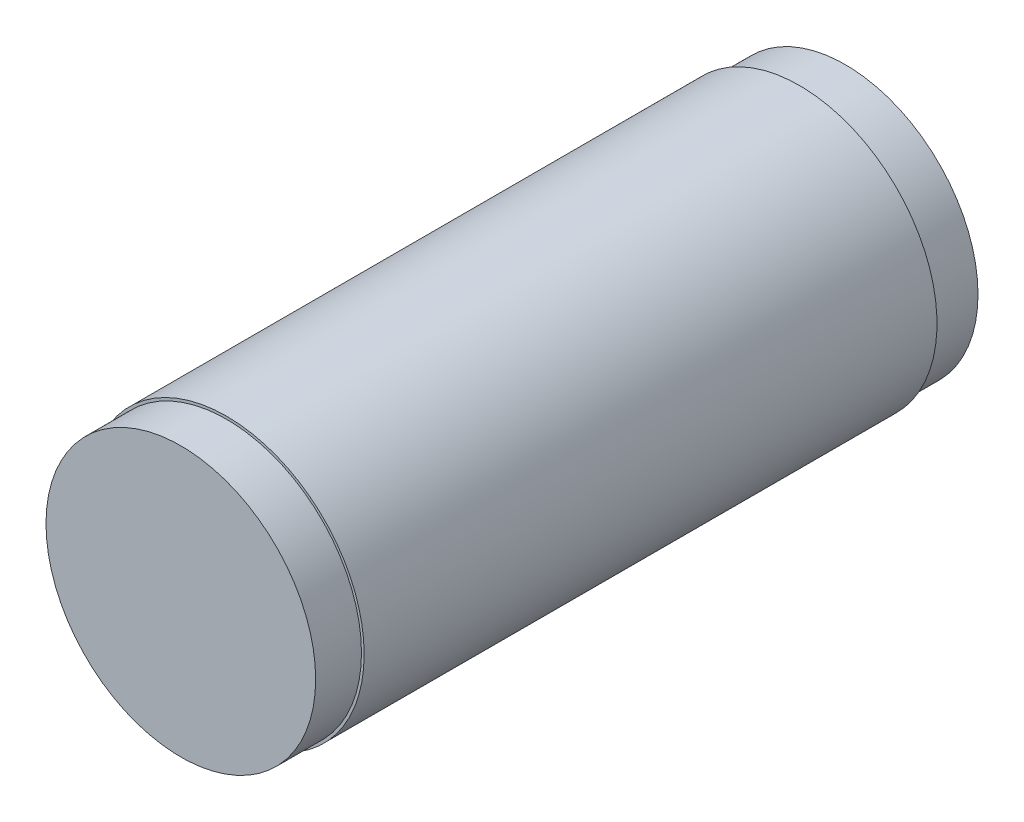
ISO-10303-21;
HEADER;
FILE_DESCRIPTION(('STEP AP214'),'2;1');
FILE_NAME('part.step','',(''),(''),'','','');
FILE_SCHEMA(('AUTOMOTIVE_DESIGN { 1 0 10303 214 1 1 1 1 }'));
ENDSEC;
DATA;
#1=APPLICATION_CONTEXT('core data for automotive mechanical design processes');
#2=APPLICATION_PROTOCOL_DEFINITION('international standard','automotive_design',2000,#1);
#3=PRODUCT_CONTEXT('',#1,'mechanical');
#4=PRODUCT('Part','Part','',(#3));
#5=PRODUCT_RELATED_PRODUCT_CATEGORY('part','',(#4));
#6=PRODUCT_DEFINITION_FORMATION('','',#4);
#7=PRODUCT_DEFINITION_CONTEXT('part definition',#1,'design');
#8=PRODUCT_DEFINITION('design','',#6,#7);
#9=PRODUCT_DEFINITION_SHAPE('','',#8);
#10=(LENGTH_UNIT() NAMED_UNIT(*) SI_UNIT(.MILLI.,.METRE.));
#11=(NAMED_UNIT(*) PLANE_ANGLE_UNIT() SI_UNIT($,.RADIAN.));
#12=(NAMED_UNIT(*) SI_UNIT($,.STERADIAN.) SOLID_ANGLE_UNIT());
#13=UNCERTAINTY_MEASURE_WITH_UNIT(LENGTH_MEASURE(1.E-05),#10,'distance_accuracy_value','');
#14=(GEOMETRIC_REPRESENTATION_CONTEXT(3) GLOBAL_UNCERTAINTY_ASSIGNED_CONTEXT((#13)) GLOBAL_UNIT_ASSIGNED_CONTEXT((#10,
#11,#12)) REPRESENTATION_CONTEXT('',''));
#15=CARTESIAN_POINT('',(0.,0.,0.));
#16=DIRECTION('',(0.,0.,1.));
#17=DIRECTION('',(1.,0.,0.));
#18=AXIS2_PLACEMENT_3D('',#15,#16,#17);
#19=CARTESIAN_POINT('',(0.,0.,145.));
#20=DIRECTION('',(0.,0.,-1.));
#21=DIRECTION('',(-1.,0.,0.));
#22=AXIS2_PLACEMENT_3D('',#19,#20,#21);
#23=CYLINDRICAL_SURFACE('',#22,30.);
#24=CARTESIAN_POINT('',(0.,0.,10.));
#25=DIRECTION('',(0.,0.,-1.));
#26=DIRECTION('',(-1.,0.,0.));
#27=AXIS2_PLACEMENT_3D('',#24,#25,#26);
#28=CIRCLE('',#27,30.);
#29=CARTESIAN_POINT('',(-30.,0.,10.));
#30=VERTEX_POINT('',#29);
#31=EDGE_CURVE('E53',#30,#30,#28,.T.);
#32=ORIENTED_EDGE('',*,*,#31,.F.);
#33=EDGE_LOOP('',(#32));
#34=FACE_BOUND('',#33,.T.);
#35=CARTESIAN_POINT('',(0.,0.,135.));
#36=DIRECTION('',(0.,0.,1.));
#37=DIRECTION('',(1.,0.,0.));
#38=AXIS2_PLACEMENT_3D('',#35,#36,#37);
#39=CIRCLE('',#38,30.);
#40=CARTESIAN_POINT('',(30.,0.,135.));
#41=VERTEX_POINT('',#40);
#42=EDGE_CURVE('E65',#41,#41,#39,.T.);
#43=ORIENTED_EDGE('',*,*,#42,.F.);
#44=EDGE_LOOP('',(#43));
#45=FACE_BOUND('',#44,.T.);
#46=ADVANCED_FACE('F40',(#34,#45),#23,.T.);
#47=CARTESIAN_POINT('',(0.,0.,10.));
#48=DIRECTION('',(0.,0.,-1.));
#49=DIRECTION('',(-1.,0.,0.));
#50=AXIS2_PLACEMENT_3D('',#47,#48,#49);
#51=PLANE('',#50);
#52=CARTESIAN_POINT('',(0.,0.,10.));
#53=DIRECTION('',(0.,0.,-1.));
#54=DIRECTION('',(-1.,0.,0.));
#55=AXIS2_PLACEMENT_3D('',#52,#53,#54);
#56=CIRCLE('',#55,28.9459801007032);
#57=CARTESIAN_POINT('',(-28.9459801007032,0.,10.));
#58=VERTEX_POINT('',#57);
#59=EDGE_CURVE('E58',#58,#58,#56,.T.);
#60=ORIENTED_EDGE('',*,*,#59,.F.);
#61=EDGE_LOOP('',(#60));
#62=FACE_BOUND('',#61,.T.);
#63=ORIENTED_EDGE('',*,*,#31,.T.);
#64=EDGE_LOOP('',(#63));
#65=FACE_BOUND('',#64,.T.);
#66=ADVANCED_FACE('F92',(#62,#65),#51,.T.);
#67=CARTESIAN_POINT('',(0.,0.,10.));
#68=DIRECTION('',(0.,0.,-1.));
#69=DIRECTION('',(-1.,0.,0.));
#70=AXIS2_PLACEMENT_3D('',#67,#68,#69);
#71=CYLINDRICAL_SURFACE('',#70,28.9459801007032);
#72=ORIENTED_EDGE('',*,*,#59,.T.);
#73=EDGE_LOOP('',(#72));
#74=FACE_BOUND('',#73,.T.);
#75=CARTESIAN_POINT('',(0.,0.,0.));
#76=DIRECTION('',(0.,0.,-1.));
#77=DIRECTION('',(-1.,0.,0.));
#78=AXIS2_PLACEMENT_3D('',#75,#76,#77);
#79=CIRCLE('',#78,28.9459801007032);
#80=CARTESIAN_POINT('',(-28.9459801007032,0.,0.));
#81=VERTEX_POINT('',#80);
#82=EDGE_CURVE('E61',#81,#81,#79,.T.);
#83=ORIENTED_EDGE('',*,*,#82,.F.);
#84=EDGE_LOOP('',(#83));
#85=FACE_BOUND('',#84,.T.);
#86=ADVANCED_FACE('F97',(#74,#85),#71,.T.);
#87=CARTESIAN_POINT('',(0.,0.,0.));
#88=DIRECTION('',(0.,0.,1.));
#89=DIRECTION('',(1.,0.,0.));
#90=AXIS2_PLACEMENT_3D('',#87,#88,#89);
#91=PLANE('',#90);
#92=ORIENTED_EDGE('',*,*,#82,.T.);
#93=EDGE_LOOP('',(#92));
#94=FACE_BOUND('',#93,.T.);
#95=ADVANCED_FACE('F87',(#94),#91,.F.);
#96=CARTESIAN_POINT('',(0.,0.,135.));
#97=DIRECTION('',(0.,0.,1.));
#98=DIRECTION('',(1.,0.,0.));
#99=AXIS2_PLACEMENT_3D('',#96,#97,#98);
#100=PLANE('',#99);
#101=CARTESIAN_POINT('',(0.,0.,135.));
#102=DIRECTION('',(0.,0.,1.));
#103=DIRECTION('',(1.,0.,0.));
#104=AXIS2_PLACEMENT_3D('',#101,#102,#103);
#105=CIRCLE('',#104,29.4209543631188);
#106=CARTESIAN_POINT('',(29.4209543631188,0.,135.));
#107=VERTEX_POINT('',#106);
#108=EDGE_CURVE('E72',#107,#107,#105,.T.);
#109=ORIENTED_EDGE('',*,*,#108,.F.);
#110=EDGE_LOOP('',(#109));
#111=FACE_BOUND('',#110,.T.);
#112=ORIENTED_EDGE('',*,*,#42,.T.);
#113=EDGE_LOOP('',(#112));
#114=FACE_BOUND('',#113,.T.);
#115=ADVANCED_FACE('F84',(#111,#114),#100,.T.);
#116=CARTESIAN_POINT('',(0.,0.,135.));
#117=DIRECTION('',(0.,0.,1.));
#118=DIRECTION('',(1.,0.,0.));
#119=AXIS2_PLACEMENT_3D('',#116,#117,#118);
#120=CYLINDRICAL_SURFACE('',#119,29.4209543631188);
#121=ORIENTED_EDGE('',*,*,#108,.T.);
#122=EDGE_LOOP('',(#121));
#123=FACE_BOUND('',#122,.T.);
#124=CARTESIAN_POINT('',(0.,0.,145.));
#125=DIRECTION('',(0.,0.,1.));
#126=DIRECTION('',(1.,0.,0.));
#127=AXIS2_PLACEMENT_3D('',#124,#125,#126);
#128=CIRCLE('',#127,29.4209543631188);
#129=CARTESIAN_POINT('',(29.4209543631188,0.,145.));
#130=VERTEX_POINT('',#129);
#131=EDGE_CURVE('E73',#130,#130,#128,.T.);
#132=ORIENTED_EDGE('',*,*,#131,.F.);
#133=EDGE_LOOP('',(#132));
#134=FACE_BOUND('',#133,.T.);
#135=ADVANCED_FACE('F81',(#123,#134),#120,.T.);
#136=CARTESIAN_POINT('',(0.,0.,145.));
#137=DIRECTION('',(0.,0.,1.));
#138=DIRECTION('',(1.,0.,0.));
#139=AXIS2_PLACEMENT_3D('',#136,#137,#138);
#140=PLANE('',#139);
#141=ORIENTED_EDGE('',*,*,#131,.T.);
#142=EDGE_LOOP('',(#141));
#143=FACE_BOUND('',#142,.T.);
#144=ADVANCED_FACE('F121',(#143),#140,.T.);
#145=CLOSED_SHELL('',(#46,#66,#86,#95,#115,#135,#144));
#146=CARTESIAN_POINT('',(0.,0.,10.));
#147=DIRECTION('',(0.,0.,1.));
#148=DIRECTION('',(1.,0.,0.));
#149=AXIS2_PLACEMENT_3D('',#146,#147,#148);
#150=PLANE('',#149);
#151=CARTESIAN_POINT('',(0.,0.,10.));
#152=DIRECTION('',(0.,0.,1.));
#153=DIRECTION('',(1.,0.,0.));
#154=AXIS2_PLACEMENT_3D('',#151,#152,#153);
#155=CIRCLE('',#154,25.);
#156=CARTESIAN_POINT('',(25.,0.,10.));
#157=VERTEX_POINT('',#156);
#158=EDGE_CURVE('E10',#157,#157,#155,.T.);
#159=ORIENTED_EDGE('',*,*,#158,.T.);
#160=EDGE_LOOP('',(#159));
#161=FACE_BOUND('',#160,.T.);
#162=ADVANCED_FACE('F115',(#161),#150,.T.);
#163=CARTESIAN_POINT('',(0.,0.,145.));
#164=DIRECTION('',(0.,0.,-1.));
#165=DIRECTION('',(-1.,0.,0.));
#166=AXIS2_PLACEMENT_3D('',#163,#164,#165);
#167=CYLINDRICAL_SURFACE('',#166,25.);
#168=ORIENTED_EDGE('',*,*,#158,.F.);
#169=EDGE_LOOP('',(#168));
#170=FACE_BOUND('',#169,.T.);
#171=CARTESIAN_POINT('',(0.,0.,135.));
#172=DIRECTION('',(0.,0.,1.));
#173=DIRECTION('',(1.,0.,0.));
#174=AXIS2_PLACEMENT_3D('',#171,#172,#173);
#175=CIRCLE('',#174,25.);
#176=CARTESIAN_POINT('',(25.,0.,135.));
#177=VERTEX_POINT('',#176);
#178=EDGE_CURVE('E48',#177,#177,#175,.T.);
#179=ORIENTED_EDGE('',*,*,#178,.T.);
#180=EDGE_LOOP('',(#179));
#181=FACE_BOUND('',#180,.T.);
#182=ADVANCED_FACE('F112',(#170,#181),#167,.F.);
#183=CARTESIAN_POINT('',(0.,0.,135.));
#184=DIRECTION('',(0.,0.,1.));
#185=DIRECTION('',(1.,0.,0.));
#186=AXIS2_PLACEMENT_3D('',#183,#184,#185);
#187=PLANE('',#186);
#188=ORIENTED_EDGE('',*,*,#178,.F.);
#189=EDGE_LOOP('',(#188));
#190=FACE_BOUND('',#189,.T.);
#191=ADVANCED_FACE('F109',(#190),#187,.F.);
#192=CLOSED_SHELL('',(#162,#182,#191));
#193=ORIENTED_CLOSED_SHELL('',*,#192,.T.);
#194=BREP_WITH_VOIDS('B2',#145,(#193));
#195=ADVANCED_BREP_SHAPE_REPRESENTATION('',(#18,#194),#14);
#196=SHAPE_DEFINITION_REPRESENTATION(#9,#195);
ENDSEC;
END-ISO-10303-21;
